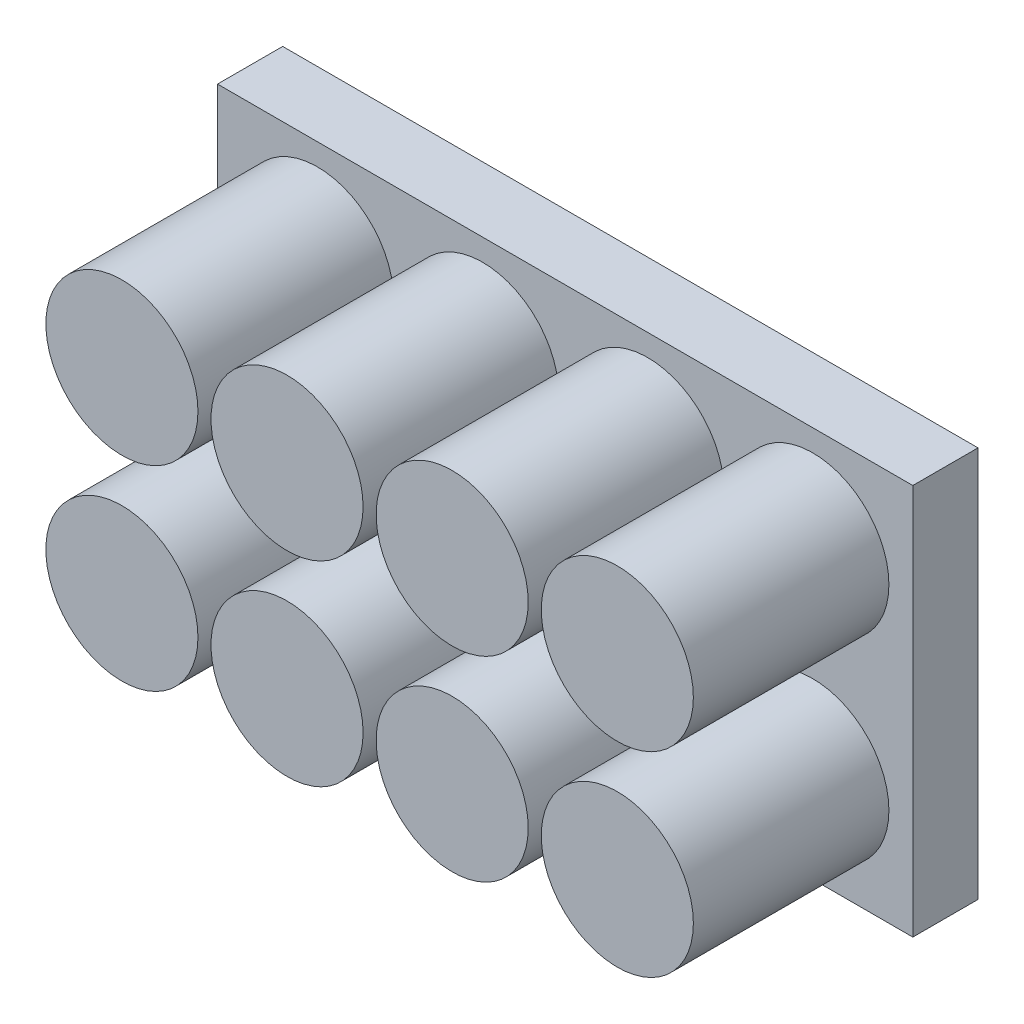
ISO-10303-21;
HEADER;
FILE_DESCRIPTION(('STEP AP214'),'2;1');
FILE_NAME('part.step','',(''),(''),'','','');
FILE_SCHEMA(('AUTOMOTIVE_DESIGN { 1 0 10303 214 1 1 1 1 }'));
ENDSEC;
DATA;
#1=APPLICATION_CONTEXT('core data for automotive mechanical design processes');
#2=APPLICATION_PROTOCOL_DEFINITION('international standard','automotive_design',2000,#1);
#3=PRODUCT_CONTEXT('',#1,'mechanical');
#4=PRODUCT('Part','Part','',(#3));
#5=PRODUCT_RELATED_PRODUCT_CATEGORY('part','',(#4));
#6=PRODUCT_DEFINITION_FORMATION('','',#4);
#7=PRODUCT_DEFINITION_CONTEXT('part definition',#1,'design');
#8=PRODUCT_DEFINITION('design','',#6,#7);
#9=PRODUCT_DEFINITION_SHAPE('','',#8);
#10=(LENGTH_UNIT() NAMED_UNIT(*) SI_UNIT(.MILLI.,.METRE.));
#11=(NAMED_UNIT(*) PLANE_ANGLE_UNIT() SI_UNIT($,.RADIAN.));
#12=(NAMED_UNIT(*) SI_UNIT($,.STERADIAN.) SOLID_ANGLE_UNIT());
#13=UNCERTAINTY_MEASURE_WITH_UNIT(LENGTH_MEASURE(1.E-05),#10,'distance_accuracy_value','');
#14=(GEOMETRIC_REPRESENTATION_CONTEXT(3) GLOBAL_UNCERTAINTY_ASSIGNED_CONTEXT((#13)) GLOBAL_UNIT_ASSIGNED_CONTEXT((#10,
#11,#12)) REPRESENTATION_CONTEXT('',''));
#15=CARTESIAN_POINT('',(0.,0.,0.));
#16=DIRECTION('',(0.,0.,1.));
#17=DIRECTION('',(1.,0.,0.));
#18=AXIS2_PLACEMENT_3D('',#15,#16,#17);
#19=CARTESIAN_POINT('',(-75.3472699175824,32.7678571428571,15.));
#20=DIRECTION('',(1.,0.,0.));
#21=DIRECTION('',(0.,1.,0.));
#22=AXIS2_PLACEMENT_3D('',#19,#20,#21);
#23=PLANE('',#22);
#24=DIRECTION('',(0.,-1.,0.));
#25=VECTOR('',#24,1.);
#26=CARTESIAN_POINT('',(-75.3472699175824,32.7678571428571,0.));
#27=LINE('',#26,#25);
#28=CARTESIAN_POINT('',(-75.3472699175824,32.7678571428571,0.));
#29=VERTEX_POINT('',#28);
#30=CARTESIAN_POINT('',(-75.3472699175824,-57.2321428571429,0.));
#31=VERTEX_POINT('',#30);
#32=EDGE_CURVE('E96',#29,#31,#27,.T.);
#33=ORIENTED_EDGE('',*,*,#32,.T.);
#34=DIRECTION('',(0.,0.,-1.));
#35=VECTOR('',#34,1.);
#36=CARTESIAN_POINT('',(-75.3472699175824,-57.2321428571429,15.));
#37=LINE('',#36,#35);
#38=CARTESIAN_POINT('',(-75.3472699175824,-57.2321428571429,15.));
#39=VERTEX_POINT('',#38);
#40=EDGE_CURVE('E11',#39,#31,#37,.T.);
#41=ORIENTED_EDGE('',*,*,#40,.F.);
#42=DIRECTION('',(0.,-1.,0.));
#43=VECTOR('',#42,1.);
#44=CARTESIAN_POINT('',(-75.3472699175824,32.7678571428571,15.));
#45=LINE('',#44,#43);
#46=CARTESIAN_POINT('',(-75.3472699175824,32.7678571428571,15.));
#47=VERTEX_POINT('',#46);
#48=EDGE_CURVE('E84',#47,#39,#45,.T.);
#49=ORIENTED_EDGE('',*,*,#48,.F.);
#50=DIRECTION('',(0.,0.,-1.));
#51=VECTOR('',#50,1.);
#52=CARTESIAN_POINT('',(-75.3472699175824,32.7678571428571,15.));
#53=LINE('',#52,#51);
#54=EDGE_CURVE('E92',#47,#29,#53,.T.);
#55=ORIENTED_EDGE('',*,*,#54,.T.);
#56=EDGE_LOOP('',(#33,#41,#49,#55));
#57=FACE_BOUND('',#56,.T.);
#58=ADVANCED_FACE('F33',(#57),#23,.F.);
#59=CARTESIAN_POINT('',(-75.3472699175824,-57.2321428571429,15.));
#60=DIRECTION('',(0.,1.,0.));
#61=DIRECTION('',(0.,0.,1.));
#62=AXIS2_PLACEMENT_3D('',#59,#60,#61);
#63=PLANE('',#62);
#64=DIRECTION('',(1.,0.,0.));
#65=VECTOR('',#64,1.);
#66=CARTESIAN_POINT('',(-75.3472699175824,-57.2321428571429,0.));
#67=LINE('',#66,#65);
#68=CARTESIAN_POINT('',(84.6527300824176,-57.2321428571429,0.));
#69=VERTEX_POINT('',#68);
#70=EDGE_CURVE('E88',#31,#69,#67,.T.);
#71=ORIENTED_EDGE('',*,*,#70,.T.);
#72=DIRECTION('',(0.,0.,-1.));
#73=VECTOR('',#72,1.);
#74=CARTESIAN_POINT('',(84.6527300824176,-57.2321428571429,15.));
#75=LINE('',#74,#73);
#76=CARTESIAN_POINT('',(84.6527300824176,-57.2321428571429,15.));
#77=VERTEX_POINT('',#76);
#78=EDGE_CURVE('E41',#77,#69,#75,.T.);
#79=ORIENTED_EDGE('',*,*,#78,.F.);
#80=DIRECTION('',(1.,0.,0.));
#81=VECTOR('',#80,1.);
#82=CARTESIAN_POINT('',(-75.3472699175824,-57.2321428571429,15.));
#83=LINE('',#82,#81);
#84=EDGE_CURVE('E79',#39,#77,#83,.T.);
#85=ORIENTED_EDGE('',*,*,#84,.F.);
#86=ORIENTED_EDGE('',*,*,#40,.T.);
#87=EDGE_LOOP('',(#71,#79,#85,#86));
#88=FACE_BOUND('',#87,.T.);
#89=ADVANCED_FACE('F87',(#88),#63,.F.);
#90=CARTESIAN_POINT('',(84.6527300824176,32.7678571428571,15.));
#91=DIRECTION('',(-1.,0.,0.));
#92=DIRECTION('',(0.,-1.,0.));
#93=AXIS2_PLACEMENT_3D('',#90,#91,#92);
#94=PLANE('',#93);
#95=DIRECTION('',(0.,1.,0.));
#96=VECTOR('',#95,1.);
#97=CARTESIAN_POINT('',(84.6527300824176,32.7678571428571,0.));
#98=LINE('',#97,#96);
#99=CARTESIAN_POINT('',(84.6527300824176,32.7678571428571,0.));
#100=VERTEX_POINT('',#99);
#101=EDGE_CURVE('E66',#69,#100,#98,.T.);
#102=ORIENTED_EDGE('',*,*,#101,.T.);
#103=DIRECTION('',(0.,0.,-1.));
#104=VECTOR('',#103,1.);
#105=CARTESIAN_POINT('',(84.6527300824176,32.7678571428571,15.));
#106=LINE('',#105,#104);
#107=CARTESIAN_POINT('',(84.6527300824176,32.7678571428571,15.));
#108=VERTEX_POINT('',#107);
#109=EDGE_CURVE('E89',#108,#100,#106,.T.);
#110=ORIENTED_EDGE('',*,*,#109,.F.);
#111=DIRECTION('',(0.,1.,0.));
#112=VECTOR('',#111,1.);
#113=CARTESIAN_POINT('',(84.6527300824176,32.7678571428571,15.));
#114=LINE('',#113,#112);
#115=EDGE_CURVE('E82',#77,#108,#114,.T.);
#116=ORIENTED_EDGE('',*,*,#115,.F.);
#117=ORIENTED_EDGE('',*,*,#78,.T.);
#118=EDGE_LOOP('',(#102,#110,#116,#117));
#119=FACE_BOUND('',#118,.T.);
#120=ADVANCED_FACE('F90',(#119),#94,.F.);
#121=CARTESIAN_POINT('',(-75.3472699175824,32.7678571428571,15.));
#122=DIRECTION('',(0.,-1.,0.));
#123=DIRECTION('',(0.,0.,-1.));
#124=AXIS2_PLACEMENT_3D('',#121,#122,#123);
#125=PLANE('',#124);
#126=DIRECTION('',(-1.,0.,0.));
#127=VECTOR('',#126,1.);
#128=CARTESIAN_POINT('',(-75.3472699175824,32.7678571428571,0.));
#129=LINE('',#128,#127);
#130=EDGE_CURVE('E72',#100,#29,#129,.T.);
#131=ORIENTED_EDGE('',*,*,#130,.T.);
#132=ORIENTED_EDGE('',*,*,#54,.F.);
#133=DIRECTION('',(-1.,0.,0.));
#134=VECTOR('',#133,1.);
#135=CARTESIAN_POINT('',(-75.3472699175824,32.7678571428571,15.));
#136=LINE('',#135,#134);
#137=EDGE_CURVE('E49',#108,#47,#136,.T.);
#138=ORIENTED_EDGE('',*,*,#137,.F.);
#139=ORIENTED_EDGE('',*,*,#109,.T.);
#140=EDGE_LOOP('',(#131,#132,#138,#139));
#141=FACE_BOUND('',#140,.T.);
#142=ADVANCED_FACE('F104',(#141),#125,.F.);
#143=CARTESIAN_POINT('',(0.,0.,15.));
#144=DIRECTION('',(0.,0.,1.));
#145=DIRECTION('',(1.,0.,0.));
#146=AXIS2_PLACEMENT_3D('',#143,#144,#145);
#147=PLANE('',#146);
#148=CARTESIAN_POINT('',(-52.3472699175819,-34.7321428571429,15.));
#149=DIRECTION('',(0.,0.,1.));
#150=DIRECTION('',(1.,0.,0.));
#151=AXIS2_PLACEMENT_3D('',#148,#149,#150);
#152=CIRCLE('',#151,17.5);
#153=CARTESIAN_POINT('',(-34.8472699175819,-34.7321428571429,15.));
#154=VERTEX_POINT('',#153);
#155=EDGE_CURVE('E152',#154,#154,#152,.T.);
#156=ORIENTED_EDGE('',*,*,#155,.F.);
#157=EDGE_LOOP('',(#156));
#158=FACE_BOUND('',#157,.T.);
#159=CARTESIAN_POINT('',(61.6527300824181,-34.7321428571429,15.));
#160=DIRECTION('',(0.,0.,1.));
#161=DIRECTION('',(1.,0.,0.));
#162=AXIS2_PLACEMENT_3D('',#159,#160,#161);
#163=CIRCLE('',#162,17.5);
#164=CARTESIAN_POINT('',(79.1527300824181,-34.7321428571429,15.));
#165=VERTEX_POINT('',#164);
#166=EDGE_CURVE('E146',#165,#165,#163,.T.);
#167=ORIENTED_EDGE('',*,*,#166,.F.);
#168=EDGE_LOOP('',(#167));
#169=FACE_BOUND('',#168,.T.);
#170=CARTESIAN_POINT('',(23.6527300824181,-34.7321428571429,15.));
#171=DIRECTION('',(0.,0.,1.));
#172=DIRECTION('',(1.,0.,0.));
#173=AXIS2_PLACEMENT_3D('',#170,#171,#172);
#174=CIRCLE('',#173,17.5);
#175=CARTESIAN_POINT('',(41.1527300824181,-34.7321428571429,15.));
#176=VERTEX_POINT('',#175);
#177=EDGE_CURVE('E140',#176,#176,#174,.T.);
#178=ORIENTED_EDGE('',*,*,#177,.F.);
#179=EDGE_LOOP('',(#178));
#180=FACE_BOUND('',#179,.T.);
#181=CARTESIAN_POINT('',(-14.3472699175819,-34.7321428571429,15.));
#182=DIRECTION('',(0.,0.,1.));
#183=DIRECTION('',(1.,0.,0.));
#184=AXIS2_PLACEMENT_3D('',#181,#182,#183);
#185=CIRCLE('',#184,17.5);
#186=CARTESIAN_POINT('',(3.15273008241811,-34.7321428571429,15.));
#187=VERTEX_POINT('',#186);
#188=EDGE_CURVE('E134',#187,#187,#185,.T.);
#189=ORIENTED_EDGE('',*,*,#188,.F.);
#190=EDGE_LOOP('',(#189));
#191=FACE_BOUND('',#190,.T.);
#192=CARTESIAN_POINT('',(61.6527300824176,10.2678571428571,15.));
#193=DIRECTION('',(0.,0.,1.));
#194=DIRECTION('',(1.,0.,0.));
#195=AXIS2_PLACEMENT_3D('',#192,#193,#194);
#196=CIRCLE('',#195,17.5);
#197=CARTESIAN_POINT('',(79.1527300824176,10.2678571428571,15.));
#198=VERTEX_POINT('',#197);
#199=EDGE_CURVE('E128',#198,#198,#196,.T.);
#200=ORIENTED_EDGE('',*,*,#199,.F.);
#201=EDGE_LOOP('',(#200));
#202=FACE_BOUND('',#201,.T.);
#203=CARTESIAN_POINT('',(23.6527300824176,10.2678571428571,15.));
#204=DIRECTION('',(0.,0.,1.));
#205=DIRECTION('',(1.,0.,0.));
#206=AXIS2_PLACEMENT_3D('',#203,#204,#205);
#207=CIRCLE('',#206,17.5);
#208=CARTESIAN_POINT('',(41.1527300824176,10.2678571428571,15.));
#209=VERTEX_POINT('',#208);
#210=EDGE_CURVE('E122',#209,#209,#207,.T.);
#211=ORIENTED_EDGE('',*,*,#210,.F.);
#212=EDGE_LOOP('',(#211));
#213=FACE_BOUND('',#212,.T.);
#214=CARTESIAN_POINT('',(-14.3472699175824,10.2678571428571,15.));
#215=DIRECTION('',(0.,0.,1.));
#216=DIRECTION('',(1.,0.,0.));
#217=AXIS2_PLACEMENT_3D('',#214,#215,#216);
#218=CIRCLE('',#217,17.5);
#219=CARTESIAN_POINT('',(3.15273008241764,10.2678571428571,15.));
#220=VERTEX_POINT('',#219);
#221=EDGE_CURVE('E116',#220,#220,#218,.T.);
#222=ORIENTED_EDGE('',*,*,#221,.F.);
#223=EDGE_LOOP('',(#222));
#224=FACE_BOUND('',#223,.T.);
#225=CARTESIAN_POINT('',(-52.3472699175824,10.2678571428571,15.));
#226=DIRECTION('',(0.,0.,1.));
#227=DIRECTION('',(1.,0.,0.));
#228=AXIS2_PLACEMENT_3D('',#225,#226,#227);
#229=CIRCLE('',#228,17.5);
#230=CARTESIAN_POINT('',(-34.8472699175824,10.2678571428571,15.));
#231=VERTEX_POINT('',#230);
#232=EDGE_CURVE('E110',#231,#231,#229,.T.);
#233=ORIENTED_EDGE('',*,*,#232,.F.);
#234=EDGE_LOOP('',(#233));
#235=FACE_BOUND('',#234,.T.);
#236=ORIENTED_EDGE('',*,*,#48,.T.);
#237=ORIENTED_EDGE('',*,*,#84,.T.);
#238=ORIENTED_EDGE('',*,*,#115,.T.);
#239=ORIENTED_EDGE('',*,*,#137,.T.);
#240=EDGE_LOOP('',(#236,#237,#238,#239));
#241=FACE_BOUND('',#240,.T.);
#242=ADVANCED_FACE('F80',(#158,#169,#180,#191,#202,#213,#224,#235,#241),#147,.T.);
#243=CARTESIAN_POINT('',(0.,0.,0.));
#244=DIRECTION('',(0.,0.,1.));
#245=DIRECTION('',(1.,0.,0.));
#246=AXIS2_PLACEMENT_3D('',#243,#244,#245);
#247=PLANE('',#246);
#248=ORIENTED_EDGE('',*,*,#32,.F.);
#249=ORIENTED_EDGE('',*,*,#130,.F.);
#250=ORIENTED_EDGE('',*,*,#101,.F.);
#251=ORIENTED_EDGE('',*,*,#70,.F.);
#252=EDGE_LOOP('',(#248,#249,#250,#251));
#253=FACE_BOUND('',#252,.T.);
#254=ADVANCED_FACE('F107',(#253),#247,.F.);
#255=CARTESIAN_POINT('',(-52.3472699175824,10.2678571428571,60.));
#256=DIRECTION('',(0.,0.,-1.));
#257=DIRECTION('',(-1.,0.,0.));
#258=AXIS2_PLACEMENT_3D('',#255,#256,#257);
#259=CYLINDRICAL_SURFACE('',#258,17.5);
#260=CARTESIAN_POINT('',(-52.3472699175824,10.2678571428571,60.));
#261=DIRECTION('',(0.,0.,1.));
#262=DIRECTION('',(1.,0.,0.));
#263=AXIS2_PLACEMENT_3D('',#260,#261,#262);
#264=CIRCLE('',#263,17.5);
#265=CARTESIAN_POINT('',(-34.8472699175824,10.2678571428571,60.));
#266=VERTEX_POINT('',#265);
#267=EDGE_CURVE('E99',#266,#266,#264,.T.);
#268=ORIENTED_EDGE('',*,*,#267,.F.);
#269=EDGE_LOOP('',(#268));
#270=FACE_BOUND('',#269,.T.);
#271=ORIENTED_EDGE('',*,*,#232,.T.);
#272=EDGE_LOOP('',(#271));
#273=FACE_BOUND('',#272,.T.);
#274=ADVANCED_FACE('F184',(#270,#273),#259,.T.);
#275=CARTESIAN_POINT('',(-52.3472699175824,10.2678571428571,60.));
#276=DIRECTION('',(0.,0.,1.));
#277=DIRECTION('',(1.,0.,0.));
#278=AXIS2_PLACEMENT_3D('',#275,#276,#277);
#279=PLANE('',#278);
#280=ORIENTED_EDGE('',*,*,#267,.T.);
#281=EDGE_LOOP('',(#280));
#282=FACE_BOUND('',#281,.T.);
#283=ADVANCED_FACE('F186',(#282),#279,.T.);
#284=CARTESIAN_POINT('',(-14.3472699175824,10.2678571428571,60.));
#285=DIRECTION('',(0.,0.,-1.));
#286=DIRECTION('',(-1.,0.,0.));
#287=AXIS2_PLACEMENT_3D('',#284,#285,#286);
#288=CYLINDRICAL_SURFACE('',#287,17.5);
#289=CARTESIAN_POINT('',(-14.3472699175824,10.2678571428571,60.));
#290=DIRECTION('',(0.,0.,1.));
#291=DIRECTION('',(1.,0.,0.));
#292=AXIS2_PLACEMENT_3D('',#289,#290,#291);
#293=CIRCLE('',#292,17.5);
#294=CARTESIAN_POINT('',(3.15273008241764,10.2678571428571,60.));
#295=VERTEX_POINT('',#294);
#296=EDGE_CURVE('E113',#295,#295,#293,.T.);
#297=ORIENTED_EDGE('',*,*,#296,.F.);
#298=EDGE_LOOP('',(#297));
#299=FACE_BOUND('',#298,.T.);
#300=ORIENTED_EDGE('',*,*,#221,.T.);
#301=EDGE_LOOP('',(#300));
#302=FACE_BOUND('',#301,.T.);
#303=ADVANCED_FACE('F193',(#299,#302),#288,.T.);
#304=CARTESIAN_POINT('',(-14.3472699175824,10.2678571428571,60.));
#305=DIRECTION('',(0.,0.,1.));
#306=DIRECTION('',(1.,0.,0.));
#307=AXIS2_PLACEMENT_3D('',#304,#305,#306);
#308=PLANE('',#307);
#309=ORIENTED_EDGE('',*,*,#296,.T.);
#310=EDGE_LOOP('',(#309));
#311=FACE_BOUND('',#310,.T.);
#312=ADVANCED_FACE('F241',(#311),#308,.T.);
#313=CARTESIAN_POINT('',(23.6527300824176,10.2678571428571,60.));
#314=DIRECTION('',(0.,0.,-1.));
#315=DIRECTION('',(-1.,0.,0.));
#316=AXIS2_PLACEMENT_3D('',#313,#314,#315);
#317=CYLINDRICAL_SURFACE('',#316,17.5);
#318=CARTESIAN_POINT('',(23.6527300824176,10.2678571428571,60.));
#319=DIRECTION('',(0.,0.,1.));
#320=DIRECTION('',(1.,0.,0.));
#321=AXIS2_PLACEMENT_3D('',#318,#319,#320);
#322=CIRCLE('',#321,17.5);
#323=CARTESIAN_POINT('',(41.1527300824176,10.2678571428571,60.));
#324=VERTEX_POINT('',#323);
#325=EDGE_CURVE('E119',#324,#324,#322,.T.);
#326=ORIENTED_EDGE('',*,*,#325,.F.);
#327=EDGE_LOOP('',(#326));
#328=FACE_BOUND('',#327,.T.);
#329=ORIENTED_EDGE('',*,*,#210,.T.);
#330=EDGE_LOOP('',(#329));
#331=FACE_BOUND('',#330,.T.);
#332=ADVANCED_FACE('F250',(#328,#331),#317,.T.);
#333=CARTESIAN_POINT('',(23.6527300824176,10.2678571428571,60.));
#334=DIRECTION('',(0.,0.,1.));
#335=DIRECTION('',(1.,0.,0.));
#336=AXIS2_PLACEMENT_3D('',#333,#334,#335);
#337=PLANE('',#336);
#338=ORIENTED_EDGE('',*,*,#325,.T.);
#339=EDGE_LOOP('',(#338));
#340=FACE_BOUND('',#339,.T.);
#341=ADVANCED_FACE('F259',(#340),#337,.T.);
#342=CARTESIAN_POINT('',(61.6527300824176,10.2678571428571,60.));
#343=DIRECTION('',(0.,0.,-1.));
#344=DIRECTION('',(-1.,0.,0.));
#345=AXIS2_PLACEMENT_3D('',#342,#343,#344);
#346=CYLINDRICAL_SURFACE('',#345,17.5);
#347=CARTESIAN_POINT('',(61.6527300824176,10.2678571428571,60.));
#348=DIRECTION('',(0.,0.,1.));
#349=DIRECTION('',(1.,0.,0.));
#350=AXIS2_PLACEMENT_3D('',#347,#348,#349);
#351=CIRCLE('',#350,17.5);
#352=CARTESIAN_POINT('',(79.1527300824176,10.2678571428571,60.));
#353=VERTEX_POINT('',#352);
#354=EDGE_CURVE('E125',#353,#353,#351,.T.);
#355=ORIENTED_EDGE('',*,*,#354,.F.);
#356=EDGE_LOOP('',(#355));
#357=FACE_BOUND('',#356,.T.);
#358=ORIENTED_EDGE('',*,*,#199,.T.);
#359=EDGE_LOOP('',(#358));
#360=FACE_BOUND('',#359,.T.);
#361=ADVANCED_FACE('F268',(#357,#360),#346,.T.);
#362=CARTESIAN_POINT('',(61.6527300824176,10.2678571428571,60.));
#363=DIRECTION('',(0.,0.,1.));
#364=DIRECTION('',(1.,0.,0.));
#365=AXIS2_PLACEMENT_3D('',#362,#363,#364);
#366=PLANE('',#365);
#367=ORIENTED_EDGE('',*,*,#354,.T.);
#368=EDGE_LOOP('',(#367));
#369=FACE_BOUND('',#368,.T.);
#370=ADVANCED_FACE('F277',(#369),#366,.T.);
#371=CARTESIAN_POINT('',(-14.3472699175819,-34.7321428571429,60.));
#372=DIRECTION('',(0.,0.,-1.));
#373=DIRECTION('',(-1.,0.,0.));
#374=AXIS2_PLACEMENT_3D('',#371,#372,#373);
#375=CYLINDRICAL_SURFACE('',#374,17.5);
#376=CARTESIAN_POINT('',(-14.3472699175819,-34.7321428571429,60.));
#377=DIRECTION('',(0.,0.,1.));
#378=DIRECTION('',(1.,0.,0.));
#379=AXIS2_PLACEMENT_3D('',#376,#377,#378);
#380=CIRCLE('',#379,17.5);
#381=CARTESIAN_POINT('',(3.15273008241811,-34.7321428571429,60.));
#382=VERTEX_POINT('',#381);
#383=EDGE_CURVE('E131',#382,#382,#380,.T.);
#384=ORIENTED_EDGE('',*,*,#383,.F.);
#385=EDGE_LOOP('',(#384));
#386=FACE_BOUND('',#385,.T.);
#387=ORIENTED_EDGE('',*,*,#188,.T.);
#388=EDGE_LOOP('',(#387));
#389=FACE_BOUND('',#388,.T.);
#390=ADVANCED_FACE('F286',(#386,#389),#375,.T.);
#391=CARTESIAN_POINT('',(-14.3472699175819,-34.7321428571429,60.));
#392=DIRECTION('',(0.,0.,1.));
#393=DIRECTION('',(1.,0.,0.));
#394=AXIS2_PLACEMENT_3D('',#391,#392,#393);
#395=PLANE('',#394);
#396=ORIENTED_EDGE('',*,*,#383,.T.);
#397=EDGE_LOOP('',(#396));
#398=FACE_BOUND('',#397,.T.);
#399=ADVANCED_FACE('F295',(#398),#395,.T.);
#400=CARTESIAN_POINT('',(23.6527300824181,-34.7321428571429,60.));
#401=DIRECTION('',(0.,0.,-1.));
#402=DIRECTION('',(-1.,0.,0.));
#403=AXIS2_PLACEMENT_3D('',#400,#401,#402);
#404=CYLINDRICAL_SURFACE('',#403,17.5);
#405=CARTESIAN_POINT('',(23.6527300824181,-34.7321428571429,60.));
#406=DIRECTION('',(0.,0.,1.));
#407=DIRECTION('',(1.,0.,0.));
#408=AXIS2_PLACEMENT_3D('',#405,#406,#407);
#409=CIRCLE('',#408,17.5);
#410=CARTESIAN_POINT('',(41.1527300824181,-34.7321428571429,60.));
#411=VERTEX_POINT('',#410);
#412=EDGE_CURVE('E137',#411,#411,#409,.T.);
#413=ORIENTED_EDGE('',*,*,#412,.F.);
#414=EDGE_LOOP('',(#413));
#415=FACE_BOUND('',#414,.T.);
#416=ORIENTED_EDGE('',*,*,#177,.T.);
#417=EDGE_LOOP('',(#416));
#418=FACE_BOUND('',#417,.T.);
#419=ADVANCED_FACE('F304',(#415,#418),#404,.T.);
#420=CARTESIAN_POINT('',(23.6527300824181,-34.7321428571429,60.));
#421=DIRECTION('',(0.,0.,1.));
#422=DIRECTION('',(1.,0.,0.));
#423=AXIS2_PLACEMENT_3D('',#420,#421,#422);
#424=PLANE('',#423);
#425=ORIENTED_EDGE('',*,*,#412,.T.);
#426=EDGE_LOOP('',(#425));
#427=FACE_BOUND('',#426,.T.);
#428=ADVANCED_FACE('F313',(#427),#424,.T.);
#429=CARTESIAN_POINT('',(61.6527300824181,-34.7321428571429,60.));
#430=DIRECTION('',(0.,0.,-1.));
#431=DIRECTION('',(-1.,0.,0.));
#432=AXIS2_PLACEMENT_3D('',#429,#430,#431);
#433=CYLINDRICAL_SURFACE('',#432,17.5);
#434=CARTESIAN_POINT('',(61.6527300824181,-34.7321428571429,60.));
#435=DIRECTION('',(0.,0.,1.));
#436=DIRECTION('',(1.,0.,0.));
#437=AXIS2_PLACEMENT_3D('',#434,#435,#436);
#438=CIRCLE('',#437,17.5);
#439=CARTESIAN_POINT('',(79.1527300824181,-34.7321428571429,60.));
#440=VERTEX_POINT('',#439);
#441=EDGE_CURVE('E143',#440,#440,#438,.T.);
#442=ORIENTED_EDGE('',*,*,#441,.F.);
#443=EDGE_LOOP('',(#442));
#444=FACE_BOUND('',#443,.T.);
#445=ORIENTED_EDGE('',*,*,#166,.T.);
#446=EDGE_LOOP('',(#445));
#447=FACE_BOUND('',#446,.T.);
#448=ADVANCED_FACE('F322',(#444,#447),#433,.T.);
#449=CARTESIAN_POINT('',(61.6527300824181,-34.7321428571429,60.));
#450=DIRECTION('',(0.,0.,1.));
#451=DIRECTION('',(1.,0.,0.));
#452=AXIS2_PLACEMENT_3D('',#449,#450,#451);
#453=PLANE('',#452);
#454=ORIENTED_EDGE('',*,*,#441,.T.);
#455=EDGE_LOOP('',(#454));
#456=FACE_BOUND('',#455,.T.);
#457=ADVANCED_FACE('F163',(#456),#453,.T.);
#458=CARTESIAN_POINT('',(-52.3472699175819,-34.7321428571429,60.));
#459=DIRECTION('',(0.,0.,-1.));
#460=DIRECTION('',(-1.,0.,0.));
#461=AXIS2_PLACEMENT_3D('',#458,#459,#460);
#462=CYLINDRICAL_SURFACE('',#461,17.5);
#463=CARTESIAN_POINT('',(-52.3472699175819,-34.7321428571429,60.));
#464=DIRECTION('',(0.,0.,1.));
#465=DIRECTION('',(1.,0.,0.));
#466=AXIS2_PLACEMENT_3D('',#463,#464,#465);
#467=CIRCLE('',#466,17.5);
#468=CARTESIAN_POINT('',(-34.8472699175819,-34.7321428571429,60.));
#469=VERTEX_POINT('',#468);
#470=EDGE_CURVE('E149',#469,#469,#467,.T.);
#471=ORIENTED_EDGE('',*,*,#470,.F.);
#472=EDGE_LOOP('',(#471));
#473=FACE_BOUND('',#472,.T.);
#474=ORIENTED_EDGE('',*,*,#155,.T.);
#475=EDGE_LOOP('',(#474));
#476=FACE_BOUND('',#475,.T.);
#477=ADVANCED_FACE('F160',(#473,#476),#462,.T.);
#478=CARTESIAN_POINT('',(-52.3472699175819,-34.7321428571429,60.));
#479=DIRECTION('',(0.,0.,1.));
#480=DIRECTION('',(1.,0.,0.));
#481=AXIS2_PLACEMENT_3D('',#478,#479,#480);
#482=PLANE('',#481);
#483=ORIENTED_EDGE('',*,*,#470,.T.);
#484=EDGE_LOOP('',(#483));
#485=FACE_BOUND('',#484,.T.);
#486=ADVANCED_FACE('F158',(#485),#482,.T.);
#487=CLOSED_SHELL('',(#58,#89,#120,#142,#242,#254,#274,#283,#303,#312,#332,#341,#361,#370,#390,
#399,#419,#428,#448,#457,#477,#486));
#488=MANIFOLD_SOLID_BREP('B2',#487);
#489=ADVANCED_BREP_SHAPE_REPRESENTATION('',(#18,#488),#14);
#490=SHAPE_DEFINITION_REPRESENTATION(#9,#489);
ENDSEC;
END-ISO-10303-21;
